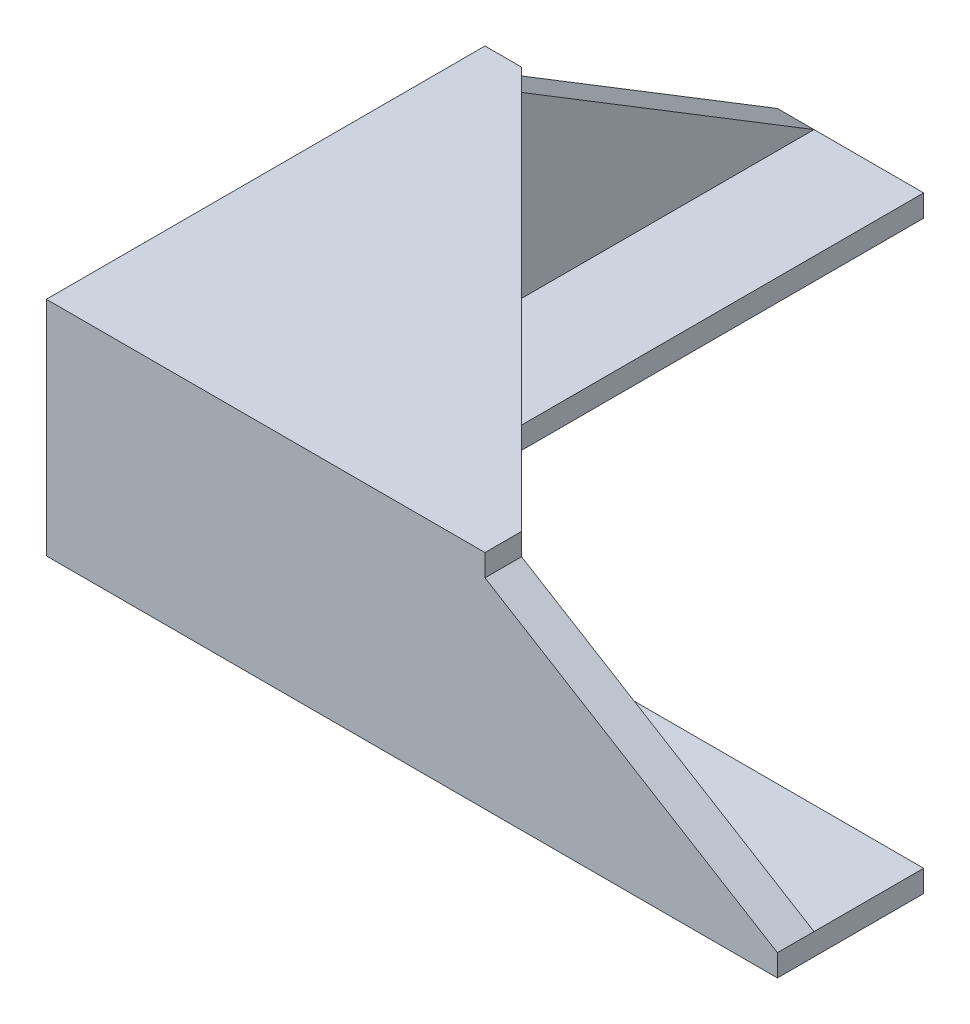
ISO-10303-21;
HEADER;
FILE_DESCRIPTION(('STEP AP214'),'2;1');
FILE_NAME('part.step','',(''),(''),'','','');
FILE_SCHEMA(('AUTOMOTIVE_DESIGN { 1 0 10303 214 1 1 1 1 }'));
ENDSEC;
DATA;
#1=APPLICATION_CONTEXT('core data for automotive mechanical design processes');
#2=APPLICATION_PROTOCOL_DEFINITION('international standard','automotive_design',2000,#1);
#3=PRODUCT_CONTEXT('',#1,'mechanical');
#4=PRODUCT('Part','Part','',(#3));
#5=PRODUCT_RELATED_PRODUCT_CATEGORY('part','',(#4));
#6=PRODUCT_DEFINITION_FORMATION('','',#4);
#7=PRODUCT_DEFINITION_CONTEXT('part definition',#1,'design');
#8=PRODUCT_DEFINITION('design','',#6,#7);
#9=PRODUCT_DEFINITION_SHAPE('','',#8);
#10=(LENGTH_UNIT() NAMED_UNIT(*) SI_UNIT(.MILLI.,.METRE.));
#11=(NAMED_UNIT(*) PLANE_ANGLE_UNIT() SI_UNIT($,.RADIAN.));
#12=(NAMED_UNIT(*) SI_UNIT($,.STERADIAN.) SOLID_ANGLE_UNIT());
#13=UNCERTAINTY_MEASURE_WITH_UNIT(LENGTH_MEASURE(1.E-05),#10,'distance_accuracy_value','');
#14=(GEOMETRIC_REPRESENTATION_CONTEXT(3) GLOBAL_UNCERTAINTY_ASSIGNED_CONTEXT((#13)) GLOBAL_UNIT_ASSIGNED_CONTEXT((#10,
#11,#12)) REPRESENTATION_CONTEXT('',''));
#15=CARTESIAN_POINT('',(0.,0.,0.));
#16=DIRECTION('',(0.,0.,1.));
#17=DIRECTION('',(1.,0.,0.));
#18=AXIS2_PLACEMENT_3D('',#15,#16,#17);
#19=CARTESIAN_POINT('',(0.,3.,0.));
#20=DIRECTION('',(0.,-1.,0.));
#21=DIRECTION('',(0.,0.,-1.));
#22=AXIS2_PLACEMENT_3D('',#19,#20,#21);
#23=PLANE('',#22);
#24=DIRECTION('',(0.,0.,-1.));
#25=VECTOR('',#24,1.);
#26=CARTESIAN_POINT('',(5.,3.,-4.99999999999999));
#27=LINE('',#26,#25);
#28=CARTESIAN_POINT('',(5.,3.,-4.99999999999999));
#29=VERTEX_POINT('',#28);
#30=CARTESIAN_POINT('',(5.,3.,-100.));
#31=VERTEX_POINT('',#30);
#32=EDGE_CURVE('E160',#29,#31,#27,.T.);
#33=ORIENTED_EDGE('',*,*,#32,.F.);
#34=DIRECTION('',(-1.,0.,0.));
#35=VECTOR('',#34,1.);
#36=CARTESIAN_POINT('',(100.,3.,-5.));
#37=LINE('',#36,#35);
#38=CARTESIAN_POINT('',(100.,3.,-5.));
#39=VERTEX_POINT('',#38);
#40=EDGE_CURVE('E156',#39,#29,#37,.T.);
#41=ORIENTED_EDGE('',*,*,#40,.F.);
#42=DIRECTION('',(0.,0.,-1.));
#43=VECTOR('',#42,1.);
#44=CARTESIAN_POINT('',(100.,3.,-20.));
#45=LINE('',#44,#43);
#46=CARTESIAN_POINT('',(100.,3.,-20.));
#47=VERTEX_POINT('',#46);
#48=EDGE_CURVE('E89',#39,#47,#45,.T.);
#49=ORIENTED_EDGE('',*,*,#48,.T.);
#50=DIRECTION('',(-1.,0.,0.));
#51=VECTOR('',#50,1.);
#52=CARTESIAN_POINT('',(20.,3.,-20.));
#53=LINE('',#52,#51);
#54=CARTESIAN_POINT('',(20.,3.,-20.));
#55=VERTEX_POINT('',#54);
#56=EDGE_CURVE('E231',#47,#55,#53,.T.);
#57=ORIENTED_EDGE('',*,*,#56,.T.);
#58=DIRECTION('',(0.,0.,-1.));
#59=VECTOR('',#58,1.);
#60=CARTESIAN_POINT('',(20.,3.,-100.));
#61=LINE('',#60,#59);
#62=CARTESIAN_POINT('',(20.,3.,-100.));
#63=VERTEX_POINT('',#62);
#64=EDGE_CURVE('E59',#55,#63,#61,.T.);
#65=ORIENTED_EDGE('',*,*,#64,.T.);
#66=DIRECTION('',(-1.,0.,0.));
#67=VECTOR('',#66,1.);
#68=CARTESIAN_POINT('',(0.,3.,-100.));
#69=LINE('',#68,#67);
#70=EDGE_CURVE('E196',#63,#31,#69,.T.);
#71=ORIENTED_EDGE('',*,*,#70,.T.);
#72=EDGE_LOOP('',(#33,#41,#49,#57,#65,#71));
#73=FACE_BOUND('',#72,.T.);
#74=ADVANCED_FACE('F33',(#73),#23,.F.);
#75=CARTESIAN_POINT('',(100.,3.,0.));
#76=DIRECTION('',(0.,0.,-1.));
#77=DIRECTION('',(-1.,0.,0.));
#78=AXIS2_PLACEMENT_3D('',#75,#76,#77);
#79=PLANE('',#78);
#80=DIRECTION('',(0.,-1.,0.));
#81=VECTOR('',#80,1.);
#82=CARTESIAN_POINT('',(100.,3.,0.));
#83=LINE('',#82,#81);
#84=CARTESIAN_POINT('',(100.,3.,0.));
#85=VERTEX_POINT('',#84);
#86=CARTESIAN_POINT('',(100.,0.,0.));
#87=VERTEX_POINT('',#86);
#88=EDGE_CURVE('E11',#85,#87,#83,.T.);
#89=ORIENTED_EDGE('',*,*,#88,.F.);
#90=DIRECTION('',(0.853703609872431,-0.520759202022183,0.));
#91=VECTOR('',#90,1.);
#92=CARTESIAN_POINT('',(60.,27.4,0.));
#93=LINE('',#92,#91);
#94=CARTESIAN_POINT('',(60.,27.4,0.));
#95=VERTEX_POINT('',#94);
#96=EDGE_CURVE('E134',#95,#85,#93,.T.);
#97=ORIENTED_EDGE('',*,*,#96,.F.);
#98=DIRECTION('',(0.,-1.,0.));
#99=VECTOR('',#98,1.);
#100=CARTESIAN_POINT('',(60.,30.4,0.));
#101=LINE('',#100,#99);
#102=CARTESIAN_POINT('',(60.,30.4,0.));
#103=VERTEX_POINT('',#102);
#104=EDGE_CURVE('E150',#103,#95,#101,.T.);
#105=ORIENTED_EDGE('',*,*,#104,.F.);
#106=DIRECTION('',(1.,0.,0.));
#107=VECTOR('',#106,1.);
#108=CARTESIAN_POINT('',(60.,30.4,0.));
#109=LINE('',#108,#107);
#110=CARTESIAN_POINT('',(0.,30.4,0.));
#111=VERTEX_POINT('',#110);
#112=EDGE_CURVE('E172',#111,#103,#109,.T.);
#113=ORIENTED_EDGE('',*,*,#112,.F.);
#114=DIRECTION('',(0.,-1.,0.));
#115=VECTOR('',#114,1.);
#116=CARTESIAN_POINT('',(0.,3.,0.));
#117=LINE('',#116,#115);
#118=CARTESIAN_POINT('',(0.,0.,0.));
#119=VERTEX_POINT('',#118);
#120=EDGE_CURVE('E199',#111,#119,#117,.T.);
#121=ORIENTED_EDGE('',*,*,#120,.T.);
#122=DIRECTION('',(1.,0.,0.));
#123=VECTOR('',#122,1.);
#124=CARTESIAN_POINT('',(100.,0.,0.));
#125=LINE('',#124,#123);
#126=EDGE_CURVE('E204',#119,#87,#125,.T.);
#127=ORIENTED_EDGE('',*,*,#126,.T.);
#128=EDGE_LOOP('',(#89,#97,#105,#113,#121,#127));
#129=FACE_BOUND('',#128,.T.);
#130=ADVANCED_FACE('F35',(#129),#79,.F.);
#131=CARTESIAN_POINT('',(100.,3.,-20.));
#132=DIRECTION('',(-1.,0.,0.));
#133=DIRECTION('',(0.,0.,1.));
#134=AXIS2_PLACEMENT_3D('',#131,#132,#133);
#135=PLANE('',#134);
#136=ORIENTED_EDGE('',*,*,#48,.F.);
#137=DIRECTION('',(0.,0.,1.));
#138=VECTOR('',#137,1.);
#139=CARTESIAN_POINT('',(100.,3.,-100.00005));
#140=LINE('',#139,#138);
#141=EDGE_CURVE('E152',#39,#85,#140,.T.);
#142=ORIENTED_EDGE('',*,*,#141,.T.);
#143=ORIENTED_EDGE('',*,*,#88,.T.);
#144=DIRECTION('',(0.,0.,-1.));
#145=VECTOR('',#144,1.);
#146=CARTESIAN_POINT('',(100.,0.,-20.));
#147=LINE('',#146,#145);
#148=CARTESIAN_POINT('',(100.,0.,-20.));
#149=VERTEX_POINT('',#148);
#150=EDGE_CURVE('E206',#87,#149,#147,.T.);
#151=ORIENTED_EDGE('',*,*,#150,.T.);
#152=DIRECTION('',(0.,-1.,0.));
#153=VECTOR('',#152,1.);
#154=CARTESIAN_POINT('',(100.,3.,-20.));
#155=LINE('',#154,#153);
#156=EDGE_CURVE('E42',#47,#149,#155,.T.);
#157=ORIENTED_EDGE('',*,*,#156,.F.);
#158=EDGE_LOOP('',(#136,#142,#143,#151,#157));
#159=FACE_BOUND('',#158,.T.);
#160=ADVANCED_FACE('F254',(#159),#135,.F.);
#161=CARTESIAN_POINT('',(20.,3.,-20.));
#162=DIRECTION('',(0.,0.,1.));
#163=DIRECTION('',(1.,0.,0.));
#164=AXIS2_PLACEMENT_3D('',#161,#162,#163);
#165=PLANE('',#164);
#166=DIRECTION('',(-1.,0.,0.));
#167=VECTOR('',#166,1.);
#168=CARTESIAN_POINT('',(20.,0.,-20.));
#169=LINE('',#168,#167);
#170=CARTESIAN_POINT('',(20.,0.,-20.));
#171=VERTEX_POINT('',#170);
#172=EDGE_CURVE('E208',#149,#171,#169,.T.);
#173=ORIENTED_EDGE('',*,*,#172,.T.);
#174=DIRECTION('',(0.,-1.,0.));
#175=VECTOR('',#174,1.);
#176=CARTESIAN_POINT('',(20.,3.,-20.));
#177=LINE('',#176,#175);
#178=EDGE_CURVE('E222',#55,#171,#177,.T.);
#179=ORIENTED_EDGE('',*,*,#178,.F.);
#180=ORIENTED_EDGE('',*,*,#56,.F.);
#181=ORIENTED_EDGE('',*,*,#156,.T.);
#182=EDGE_LOOP('',(#173,#179,#180,#181));
#183=FACE_BOUND('',#182,.T.);
#184=ADVANCED_FACE('F229',(#183),#165,.F.);
#185=CARTESIAN_POINT('',(20.,3.,-100.));
#186=DIRECTION('',(-1.,0.,0.));
#187=DIRECTION('',(0.,0.,1.));
#188=AXIS2_PLACEMENT_3D('',#185,#186,#187);
#189=PLANE('',#188);
#190=DIRECTION('',(0.,0.,-1.));
#191=VECTOR('',#190,1.);
#192=CARTESIAN_POINT('',(20.,0.,-100.));
#193=LINE('',#192,#191);
#194=CARTESIAN_POINT('',(20.,0.,-100.));
#195=VERTEX_POINT('',#194);
#196=EDGE_CURVE('E210',#171,#195,#193,.T.);
#197=ORIENTED_EDGE('',*,*,#196,.T.);
#198=DIRECTION('',(0.,-1.,0.));
#199=VECTOR('',#198,1.);
#200=CARTESIAN_POINT('',(20.,3.,-100.));
#201=LINE('',#200,#199);
#202=EDGE_CURVE('E219',#63,#195,#201,.T.);
#203=ORIENTED_EDGE('',*,*,#202,.F.);
#204=ORIENTED_EDGE('',*,*,#64,.F.);
#205=ORIENTED_EDGE('',*,*,#178,.T.);
#206=EDGE_LOOP('',(#197,#203,#204,#205));
#207=FACE_BOUND('',#206,.T.);
#208=ADVANCED_FACE('F240',(#207),#189,.F.);
#209=CARTESIAN_POINT('',(0.,3.,-100.));
#210=DIRECTION('',(0.,0.,1.));
#211=DIRECTION('',(1.,0.,0.));
#212=AXIS2_PLACEMENT_3D('',#209,#210,#211);
#213=PLANE('',#212);
#214=DIRECTION('',(0.,-1.,0.));
#215=VECTOR('',#214,1.);
#216=CARTESIAN_POINT('',(0.,3.,-100.));
#217=LINE('',#216,#215);
#218=CARTESIAN_POINT('',(0.,3.,-100.));
#219=VERTEX_POINT('',#218);
#220=CARTESIAN_POINT('',(0.,0.,-100.));
#221=VERTEX_POINT('',#220);
#222=EDGE_CURVE('E217',#219,#221,#217,.T.);
#223=ORIENTED_EDGE('',*,*,#222,.F.);
#224=DIRECTION('',(-1.,0.,0.));
#225=VECTOR('',#224,1.);
#226=CARTESIAN_POINT('',(100.00005,3.,-100.));
#227=LINE('',#226,#225);
#228=EDGE_CURVE('E246',#31,#219,#227,.T.);
#229=ORIENTED_EDGE('',*,*,#228,.F.);
#230=ORIENTED_EDGE('',*,*,#70,.F.);
#231=ORIENTED_EDGE('',*,*,#202,.T.);
#232=DIRECTION('',(-1.,0.,0.));
#233=VECTOR('',#232,1.);
#234=CARTESIAN_POINT('',(0.,0.,-100.));
#235=LINE('',#234,#233);
#236=EDGE_CURVE('E212',#195,#221,#235,.T.);
#237=ORIENTED_EDGE('',*,*,#236,.T.);
#238=EDGE_LOOP('',(#223,#229,#230,#231,#237));
#239=FACE_BOUND('',#238,.T.);
#240=ADVANCED_FACE('F244',(#239),#213,.F.);
#241=CARTESIAN_POINT('',(0.,3.,0.));
#242=DIRECTION('',(1.,0.,0.));
#243=DIRECTION('',(0.,0.,-1.));
#244=AXIS2_PLACEMENT_3D('',#241,#242,#243);
#245=PLANE('',#244);
#246=DIRECTION('',(0.,-1.,0.));
#247=VECTOR('',#246,1.);
#248=CARTESIAN_POINT('',(0.,30.4,-60.));
#249=LINE('',#248,#247);
#250=CARTESIAN_POINT('',(0.,30.4,-60.));
#251=VERTEX_POINT('',#250);
#252=CARTESIAN_POINT('',(0.,27.4,-60.));
#253=VERTEX_POINT('',#252);
#254=EDGE_CURVE('E173',#251,#253,#249,.T.);
#255=ORIENTED_EDGE('',*,*,#254,.T.);
#256=DIRECTION('',(0.,0.520759202022183,0.853703609872431));
#257=VECTOR('',#256,1.);
#258=CARTESIAN_POINT('',(0.,27.4,-60.));
#259=LINE('',#258,#257);
#260=EDGE_CURVE('E50',#219,#253,#259,.T.);
#261=ORIENTED_EDGE('',*,*,#260,.F.);
#262=ORIENTED_EDGE('',*,*,#222,.T.);
#263=DIRECTION('',(0.,0.,1.));
#264=VECTOR('',#263,1.);
#265=CARTESIAN_POINT('',(0.,0.,0.));
#266=LINE('',#265,#264);
#267=EDGE_CURVE('E84',#221,#119,#266,.T.);
#268=ORIENTED_EDGE('',*,*,#267,.T.);
#269=ORIENTED_EDGE('',*,*,#120,.F.);
#270=DIRECTION('',(0.,0.,1.));
#271=VECTOR('',#270,1.);
#272=CARTESIAN_POINT('',(0.,30.4,0.));
#273=LINE('',#272,#271);
#274=EDGE_CURVE('E274',#251,#111,#273,.T.);
#275=ORIENTED_EDGE('',*,*,#274,.F.);
#276=EDGE_LOOP('',(#255,#261,#262,#268,#269,#275));
#277=FACE_BOUND('',#276,.T.);
#278=ADVANCED_FACE('F280',(#277),#245,.F.);
#279=CARTESIAN_POINT('',(0.,0.,0.));
#280=DIRECTION('',(0.,-1.,0.));
#281=DIRECTION('',(0.,0.,-1.));
#282=AXIS2_PLACEMENT_3D('',#279,#280,#281);
#283=PLANE('',#282);
#284=ORIENTED_EDGE('',*,*,#126,.F.);
#285=ORIENTED_EDGE('',*,*,#267,.F.);
#286=ORIENTED_EDGE('',*,*,#236,.F.);
#287=ORIENTED_EDGE('',*,*,#196,.F.);
#288=ORIENTED_EDGE('',*,*,#172,.F.);
#289=ORIENTED_EDGE('',*,*,#150,.F.);
#290=EDGE_LOOP('',(#284,#285,#286,#287,#288,#289));
#291=FACE_BOUND('',#290,.T.);
#292=ADVANCED_FACE('F237',(#291),#283,.T.);
#293=CARTESIAN_POINT('',(100.,27.4,-5.));
#294=DIRECTION('',(0.,0.,1.));
#295=DIRECTION('',(1.,0.,0.));
#296=AXIS2_PLACEMENT_3D('',#293,#294,#295);
#297=PLANE('',#296);
#298=DIRECTION('',(-1.,0.,0.));
#299=VECTOR('',#298,1.);
#300=CARTESIAN_POINT('',(100.,27.4,-5.));
#301=LINE('',#300,#299);
#302=CARTESIAN_POINT('',(60.,27.4,-4.99999999999999));
#303=VERTEX_POINT('',#302);
#304=CARTESIAN_POINT('',(5.,27.4,-4.99999999999999));
#305=VERTEX_POINT('',#304);
#306=EDGE_CURVE('E181',#303,#305,#301,.T.);
#307=ORIENTED_EDGE('',*,*,#306,.F.);
#308=DIRECTION('',(0.853703609872431,-0.520759202022183,0.));
#309=VECTOR('',#308,1.);
#310=CARTESIAN_POINT('',(89.1523941403688,9.61703957437504,-5.));
#311=LINE('',#310,#309);
#312=EDGE_CURVE('E137',#303,#39,#311,.T.);
#313=ORIENTED_EDGE('',*,*,#312,.T.);
#314=ORIENTED_EDGE('',*,*,#40,.T.);
#315=DIRECTION('',(0.,-1.,0.));
#316=VECTOR('',#315,1.);
#317=CARTESIAN_POINT('',(5.,27.4,-4.99999999999999));
#318=LINE('',#317,#316);
#319=EDGE_CURVE('E187',#305,#29,#318,.T.);
#320=ORIENTED_EDGE('',*,*,#319,.F.);
#321=EDGE_LOOP('',(#307,#313,#314,#320));
#322=FACE_BOUND('',#321,.T.);
#323=ADVANCED_FACE('F253',(#322),#297,.F.);
#324=CARTESIAN_POINT('',(5.,27.4,-4.99999999999999));
#325=DIRECTION('',(-1.,0.,0.));
#326=DIRECTION('',(0.,0.,1.));
#327=AXIS2_PLACEMENT_3D('',#324,#325,#326);
#328=PLANE('',#327);
#329=ORIENTED_EDGE('',*,*,#32,.T.);
#330=DIRECTION('',(0.,0.520759202022183,0.853703609872431));
#331=VECTOR('',#330,1.);
#332=CARTESIAN_POINT('',(5.,51.8515705852343,-19.9154580569929));
#333=LINE('',#332,#331);
#334=CARTESIAN_POINT('',(5.,27.4,-60.));
#335=VERTEX_POINT('',#334);
#336=EDGE_CURVE('E144',#31,#335,#333,.T.);
#337=ORIENTED_EDGE('',*,*,#336,.T.);
#338=DIRECTION('',(0.,0.,-1.));
#339=VECTOR('',#338,1.);
#340=CARTESIAN_POINT('',(5.,27.4,-4.99999999999999));
#341=LINE('',#340,#339);
#342=EDGE_CURVE('E184',#305,#335,#341,.T.);
#343=ORIENTED_EDGE('',*,*,#342,.F.);
#344=ORIENTED_EDGE('',*,*,#319,.T.);
#345=EDGE_LOOP('',(#329,#337,#343,#344));
#346=FACE_BOUND('',#345,.T.);
#347=ADVANCED_FACE('F250',(#346),#328,.F.);
#348=CARTESIAN_POINT('',(60.,30.4,-4.99999999999999));
#349=DIRECTION('',(-1.,0.,0.));
#350=DIRECTION('',(0.,0.,1.));
#351=AXIS2_PLACEMENT_3D('',#348,#349,#350);
#352=PLANE('',#351);
#353=DIRECTION('',(0.,0.,-1.));
#354=VECTOR('',#353,1.);
#355=CARTESIAN_POINT('',(60.,27.4,-4.99999999999999));
#356=LINE('',#355,#354);
#357=EDGE_CURVE('E131',#95,#303,#356,.T.);
#358=ORIENTED_EDGE('',*,*,#357,.T.);
#359=DIRECTION('',(0.,-1.,0.));
#360=VECTOR('',#359,1.);
#361=CARTESIAN_POINT('',(60.,30.4,-4.99999999999999));
#362=LINE('',#361,#360);
#363=CARTESIAN_POINT('',(60.,30.4,-4.99999999999999));
#364=VERTEX_POINT('',#363);
#365=EDGE_CURVE('E157',#364,#303,#362,.T.);
#366=ORIENTED_EDGE('',*,*,#365,.F.);
#367=DIRECTION('',(0.,0.,-1.));
#368=VECTOR('',#367,1.);
#369=CARTESIAN_POINT('',(60.,30.4,-4.99999999999999));
#370=LINE('',#369,#368);
#371=EDGE_CURVE('E154',#103,#364,#370,.T.);
#372=ORIENTED_EDGE('',*,*,#371,.F.);
#373=ORIENTED_EDGE('',*,*,#104,.T.);
#374=EDGE_LOOP('',(#358,#366,#372,#373));
#375=FACE_BOUND('',#374,.T.);
#376=ADVANCED_FACE('F153',(#375),#352,.F.);
#377=CARTESIAN_POINT('',(5.,30.4,-60.));
#378=DIRECTION('',(-0.707106781186548,0.,0.707106781186547));
#379=DIRECTION('',(0.707106781186547,0.,0.707106781186548));
#380=AXIS2_PLACEMENT_3D('',#377,#378,#379);
#381=PLANE('',#380);
#382=DIRECTION('',(-0.707106781186547,0.,-0.707106781186548));
#383=VECTOR('',#382,1.);
#384=CARTESIAN_POINT('',(5.,27.4,-60.));
#385=LINE('',#384,#383);
#386=EDGE_CURVE('E143',#303,#335,#385,.T.);
#387=ORIENTED_EDGE('',*,*,#386,.T.);
#388=DIRECTION('',(0.,-1.,0.));
#389=VECTOR('',#388,1.);
#390=CARTESIAN_POINT('',(5.,30.4,-60.));
#391=LINE('',#390,#389);
#392=CARTESIAN_POINT('',(5.,30.4,-60.));
#393=VERTEX_POINT('',#392);
#394=EDGE_CURVE('E162',#393,#335,#391,.T.);
#395=ORIENTED_EDGE('',*,*,#394,.F.);
#396=DIRECTION('',(-0.707106781186547,0.,-0.707106781186548));
#397=VECTOR('',#396,1.);
#398=CARTESIAN_POINT('',(5.,30.4,-60.));
#399=LINE('',#398,#397);
#400=EDGE_CURVE('E271',#364,#393,#399,.T.);
#401=ORIENTED_EDGE('',*,*,#400,.F.);
#402=ORIENTED_EDGE('',*,*,#365,.T.);
#403=EDGE_LOOP('',(#387,#395,#401,#402));
#404=FACE_BOUND('',#403,.T.);
#405=ADVANCED_FACE('F358',(#404),#381,.F.);
#406=CARTESIAN_POINT('',(0.,30.4,-60.));
#407=DIRECTION('',(0.,0.,1.));
#408=DIRECTION('',(1.,0.,0.));
#409=AXIS2_PLACEMENT_3D('',#406,#407,#408);
#410=PLANE('',#409);
#411=DIRECTION('',(-1.,0.,0.));
#412=VECTOR('',#411,1.);
#413=CARTESIAN_POINT('',(0.,27.4,-60.));
#414=LINE('',#413,#412);
#415=EDGE_CURVE('E169',#335,#253,#414,.T.);
#416=ORIENTED_EDGE('',*,*,#415,.T.);
#417=ORIENTED_EDGE('',*,*,#254,.F.);
#418=DIRECTION('',(-1.,0.,0.));
#419=VECTOR('',#418,1.);
#420=CARTESIAN_POINT('',(0.,30.4,-60.));
#421=LINE('',#420,#419);
#422=EDGE_CURVE('E273',#393,#251,#421,.T.);
#423=ORIENTED_EDGE('',*,*,#422,.F.);
#424=ORIENTED_EDGE('',*,*,#394,.T.);
#425=EDGE_LOOP('',(#416,#417,#423,#424));
#426=FACE_BOUND('',#425,.T.);
#427=ADVANCED_FACE('F283',(#426),#410,.F.);
#428=CARTESIAN_POINT('',(0.,30.4,0.));
#429=DIRECTION('',(0.,-1.,0.));
#430=DIRECTION('',(0.,0.,-1.));
#431=AXIS2_PLACEMENT_3D('',#428,#429,#430);
#432=PLANE('',#431);
#433=ORIENTED_EDGE('',*,*,#112,.T.);
#434=ORIENTED_EDGE('',*,*,#371,.T.);
#435=ORIENTED_EDGE('',*,*,#400,.T.);
#436=ORIENTED_EDGE('',*,*,#422,.T.);
#437=ORIENTED_EDGE('',*,*,#274,.T.);
#438=EDGE_LOOP('',(#433,#434,#435,#436,#437));
#439=FACE_BOUND('',#438,.T.);
#440=ADVANCED_FACE('F294',(#439),#432,.F.);
#441=CARTESIAN_POINT('',(0.,27.4,0.));
#442=DIRECTION('',(0.,-1.,0.));
#443=DIRECTION('',(0.,0.,-1.));
#444=AXIS2_PLACEMENT_3D('',#441,#442,#443);
#445=PLANE('',#444);
#446=ORIENTED_EDGE('',*,*,#386,.F.);
#447=ORIENTED_EDGE('',*,*,#306,.T.);
#448=ORIENTED_EDGE('',*,*,#342,.T.);
#449=EDGE_LOOP('',(#446,#447,#448));
#450=FACE_BOUND('',#449,.T.);
#451=ADVANCED_FACE('F287',(#450),#445,.T.);
#452=CARTESIAN_POINT('',(100.00005,27.4,-60.));
#453=DIRECTION('',(0.,-0.853703609872431,0.520759202022183));
#454=DIRECTION('',(0.,-0.520759202022183,-0.853703609872431));
#455=AXIS2_PLACEMENT_3D('',#452,#453,#454);
#456=PLANE('',#455);
#457=ORIENTED_EDGE('',*,*,#228,.T.);
#458=ORIENTED_EDGE('',*,*,#260,.T.);
#459=ORIENTED_EDGE('',*,*,#415,.F.);
#460=ORIENTED_EDGE('',*,*,#336,.F.);
#461=EDGE_LOOP('',(#457,#458,#459,#460));
#462=FACE_BOUND('',#461,.T.);
#463=ADVANCED_FACE('F285',(#462),#456,.F.);
#464=CARTESIAN_POINT('',(60.,27.4,-100.00005));
#465=DIRECTION('',(-0.520759202022183,-0.853703609872431,0.));
#466=DIRECTION('',(0.853703609872431,-0.520759202022183,0.));
#467=AXIS2_PLACEMENT_3D('',#464,#465,#466);
#468=PLANE('',#467);
#469=ORIENTED_EDGE('',*,*,#357,.F.);
#470=ORIENTED_EDGE('',*,*,#96,.T.);
#471=ORIENTED_EDGE('',*,*,#141,.F.);
#472=ORIENTED_EDGE('',*,*,#312,.F.);
#473=EDGE_LOOP('',(#469,#470,#471,#472));
#474=FACE_BOUND('',#473,.T.);
#475=ADVANCED_FACE('F133',(#474),#468,.F.);
#476=CLOSED_SHELL('',(#74,#130,#160,#184,#208,#240,#278,#292,#323,#347,#376,#405,#427,#440,#451,
#463,#475));
#477=MANIFOLD_SOLID_BREP('B2',#476);
#478=ADVANCED_BREP_SHAPE_REPRESENTATION('',(#18,#477),#14);
#479=SHAPE_DEFINITION_REPRESENTATION(#9,#478);
ENDSEC;
END-ISO-10303-21;
